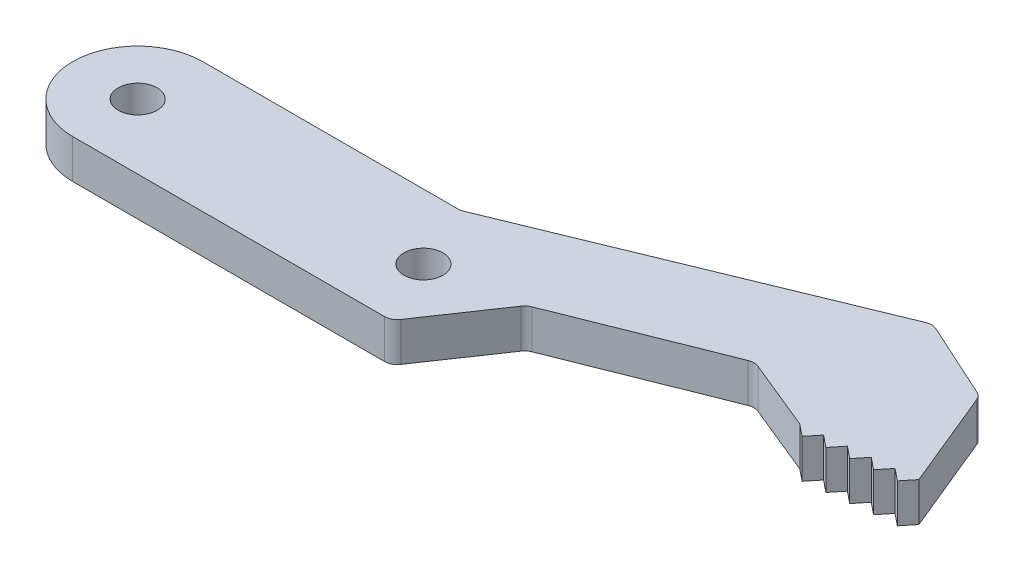
ISO-10303-21;
HEADER;
FILE_DESCRIPTION(('STEP AP214'),'2;1');
FILE_NAME('part.step','',(''),(''),'','','');
FILE_SCHEMA(('AUTOMOTIVE_DESIGN { 1 0 10303 214 1 1 1 1 }'));
ENDSEC;
DATA;
#1=APPLICATION_CONTEXT('core data for automotive mechanical design processes');
#2=APPLICATION_PROTOCOL_DEFINITION('international standard','automotive_design',2000,#1);
#3=PRODUCT_CONTEXT('',#1,'mechanical');
#4=PRODUCT('Part','Part','',(#3));
#5=PRODUCT_RELATED_PRODUCT_CATEGORY('part','',(#4));
#6=PRODUCT_DEFINITION_FORMATION('','',#4);
#7=PRODUCT_DEFINITION_CONTEXT('part definition',#1,'design');
#8=PRODUCT_DEFINITION('design','',#6,#7);
#9=PRODUCT_DEFINITION_SHAPE('','',#8);
#10=(LENGTH_UNIT() NAMED_UNIT(*) SI_UNIT(.MILLI.,.METRE.));
#11=(NAMED_UNIT(*) PLANE_ANGLE_UNIT() SI_UNIT($,.RADIAN.));
#12=(NAMED_UNIT(*) SI_UNIT($,.STERADIAN.) SOLID_ANGLE_UNIT());
#13=UNCERTAINTY_MEASURE_WITH_UNIT(LENGTH_MEASURE(1.E-05),#10,'distance_accuracy_value','');
#14=(GEOMETRIC_REPRESENTATION_CONTEXT(3) GLOBAL_UNCERTAINTY_ASSIGNED_CONTEXT((#13)) GLOBAL_UNIT_ASSIGNED_CONTEXT((#10,
#11,#12)) REPRESENTATION_CONTEXT('',''));
#15=CARTESIAN_POINT('',(0.,0.,0.));
#16=DIRECTION('',(0.,0.,1.));
#17=DIRECTION('',(1.,0.,0.));
#18=AXIS2_PLACEMENT_3D('',#15,#16,#17);
#19=CARTESIAN_POINT('',(33.2201270343521,4.2,2.2384817808513));
#20=DIRECTION('',(0.,-1.,0.));
#21=DIRECTION('',(0.,0.,-1.));
#22=AXIS2_PLACEMENT_3D('',#19,#20,#21);
#23=PLANE('',#22);
#24=CARTESIAN_POINT('',(33.2201270343521,4.2,2.2384817808513));
#25=DIRECTION('',(0.,-1.,0.));
#26=DIRECTION('',(0.,0.,-1.));
#27=AXIS2_PLACEMENT_3D('',#24,#25,#26);
#28=CIRCLE('',#27,1.8);
#29=CARTESIAN_POINT('',(31.7301470261271,4.2,1.22855130052607));
#30=VERTEX_POINT('',#29);
#31=CARTESIAN_POINT('',(32.5534154511187,4.2,0.566508197093927));
#32=VERTEX_POINT('',#31);
#33=EDGE_CURVE('E287',#30,#32,#28,.T.);
#34=ORIENTED_EDGE('',*,*,#33,.T.);
#35=DIRECTION('',(0.92887421319854,0.,-0.370395324018532));
#36=VECTOR('',#35,1.);
#37=CARTESIAN_POINT('',(32.5534154511187,4.2,0.566508197093927));
#38=LINE('',#37,#36);
#39=CARTESIAN_POINT('',(53.9864484293978,4.2,-7.98006902712785));
#40=VERTEX_POINT('',#39);
#41=EDGE_CURVE('E150',#32,#40,#38,.T.);
#42=ORIENTED_EDGE('',*,*,#41,.T.);
#43=CARTESIAN_POINT('',(54.6531600126312,4.2,-6.30809544337048));
#44=DIRECTION('',(0.,-1.,0.));
#45=DIRECTION('',(0.,0.,-1.));
#46=AXIS2_PLACEMENT_3D('',#43,#44,#45);
#47=CIRCLE('',#46,1.8);
#48=CARTESIAN_POINT('',(55.3350182806081,4.2,-7.97394936925703));
#49=VERTEX_POINT('',#48);
#50=EDGE_CURVE('E353',#40,#49,#47,.T.);
#51=ORIENTED_EDGE('',*,*,#50,.T.);
#52=DIRECTION('',(0.925474403270305,0.,0.378810148876022));
#53=VECTOR('',#52,1.);
#54=CARTESIAN_POINT('',(55.3350182806081,4.2,-7.97394936925703));
#55=LINE('',#54,#53);
#56=CARTESIAN_POINT('',(65.1735078784835,4.2,-3.94691232088836));
#57=VERTEX_POINT('',#56);
#58=EDGE_CURVE('E372',#49,#57,#55,.T.);
#59=ORIENTED_EDGE('',*,*,#58,.T.);
#60=DIRECTION('',(0.777249081254573,0.,0.629193027368329));
#61=VECTOR('',#60,1.);
#62=CARTESIAN_POINT('',(65.1735078784835,4.2,-3.94691232088836));
#63=LINE('',#62,#61);
#64=CARTESIAN_POINT('',(66.8243849270682,4.2,-2.61050633075804));
#65=VERTEX_POINT('',#64);
#66=EDGE_CURVE('E369',#57,#65,#63,.T.);
#67=ORIENTED_EDGE('',*,*,#66,.T.);
#68=DIRECTION('',(0.629193027368274,0.,-0.777249081254617));
#69=VECTOR('',#68,1.);
#70=CARTESIAN_POINT('',(66.8243849270682,4.2,-2.61050633075804));
#71=LINE('',#70,#69);
#72=CARTESIAN_POINT('',(68.1607909171984,4.2,-4.26138337934285));
#73=VERTEX_POINT('',#72);
#74=EDGE_CURVE('E371',#65,#73,#71,.T.);
#75=ORIENTED_EDGE('',*,*,#74,.T.);
#76=DIRECTION('',(0.777249081254579,0.,0.62919302736832));
#77=VECTOR('',#76,1.);
#78=CARTESIAN_POINT('',(68.1607909171984,4.2,-4.26138337934285));
#79=LINE('',#78,#77);
#80=CARTESIAN_POINT('',(69.8116679657832,4.2,-2.92497738921252));
#81=VERTEX_POINT('',#80);
#82=EDGE_CURVE('E374',#73,#81,#79,.T.);
#83=ORIENTED_EDGE('',*,*,#82,.T.);
#84=DIRECTION('',(0.629193027368325,0.,-0.777249081254575));
#85=VECTOR('',#84,1.);
#86=CARTESIAN_POINT('',(69.8116679657832,4.2,-2.92497738921252));
#87=LINE('',#86,#85);
#88=CARTESIAN_POINT('',(71.1480739559135,4.2,-4.57585443779724));
#89=VERTEX_POINT('',#88);
#90=EDGE_CURVE('E380',#81,#89,#87,.T.);
#91=ORIENTED_EDGE('',*,*,#90,.T.);
#92=DIRECTION('',(0.777249081254577,0.,0.629193027368323));
#93=VECTOR('',#92,1.);
#94=CARTESIAN_POINT('',(71.1480739559135,4.2,-4.57585443779724));
#95=LINE('',#94,#93);
#96=CARTESIAN_POINT('',(72.7989510044982,4.2,-3.23944844766692));
#97=VERTEX_POINT('',#96);
#98=EDGE_CURVE('E382',#89,#97,#95,.T.);
#99=ORIENTED_EDGE('',*,*,#98,.T.);
#100=DIRECTION('',(0.629193027368326,0.,-0.777249081254575));
#101=VECTOR('',#100,1.);
#102=CARTESIAN_POINT('',(72.7989510044982,4.2,-3.23944844766692));
#103=LINE('',#102,#101);
#104=CARTESIAN_POINT('',(74.1353569946286,4.2,-4.89032549625164));
#105=VERTEX_POINT('',#104);
#106=EDGE_CURVE('E384',#97,#105,#103,.T.);
#107=ORIENTED_EDGE('',*,*,#106,.T.);
#108=DIRECTION('',(0.777249081254583,0.,0.629193027368317));
#109=VECTOR('',#108,1.);
#110=CARTESIAN_POINT('',(74.1353569946286,4.2,-4.89032549625164));
#111=LINE('',#110,#109);
#112=CARTESIAN_POINT('',(75.7862340432133,4.2,-3.55391950612133));
#113=VERTEX_POINT('',#112);
#114=EDGE_CURVE('E386',#105,#113,#111,.T.);
#115=ORIENTED_EDGE('',*,*,#114,.T.);
#116=DIRECTION('',(0.629193027368326,0.,-0.777249081254575));
#117=VECTOR('',#116,1.);
#118=CARTESIAN_POINT('',(75.7862340432133,4.2,-3.55391950612133));
#119=LINE('',#118,#117);
#120=CARTESIAN_POINT('',(77.1226400333436,4.2,-5.20479655470605));
#121=VERTEX_POINT('',#120);
#122=EDGE_CURVE('E388',#113,#121,#119,.T.);
#123=ORIENTED_EDGE('',*,*,#122,.T.);
#124=DIRECTION('',(0.777249081254587,0.,0.629193027368311));
#125=VECTOR('',#124,1.);
#126=CARTESIAN_POINT('',(77.1226400333436,4.2,-5.20479655470605));
#127=LINE('',#126,#125);
#128=CARTESIAN_POINT('',(78.7735170819284,4.2,-3.86839056457575));
#129=VERTEX_POINT('',#128);
#130=EDGE_CURVE('E390',#121,#129,#127,.T.);
#131=ORIENTED_EDGE('',*,*,#130,.T.);
#132=DIRECTION('',(0.629193027368273,0.,-0.777249081254618));
#133=VECTOR('',#132,1.);
#134=CARTESIAN_POINT('',(78.7735170819284,4.2,-3.86839056457575));
#135=LINE('',#134,#133);
#136=CARTESIAN_POINT('',(80.1099230720585,4.2,-5.51926761316053));
#137=VERTEX_POINT('',#136);
#138=EDGE_CURVE('E392',#129,#137,#135,.T.);
#139=ORIENTED_EDGE('',*,*,#138,.T.);
#140=DIRECTION('',(-0.380263412733204,0.,-0.92487822816655));
#141=VECTOR('',#140,1.);
#142=CARTESIAN_POINT('',(74.5283952923221,4.2,-19.094682313935));
#143=LINE('',#142,#141);
#144=CARTESIAN_POINT('',(74.5283952923221,4.2,-19.094682313935));
#145=VERTEX_POINT('',#144);
#146=EDGE_CURVE('E394',#137,#145,#143,.T.);
#147=ORIENTED_EDGE('',*,*,#146,.T.);
#148=CARTESIAN_POINT('',(72.8636144816223,4.2,-18.4102081710152));
#149=DIRECTION('',(0.,1.,0.));
#150=DIRECTION('',(0.,0.,-1.));
#151=AXIS2_PLACEMENT_3D('',#148,#149,#150);
#152=CIRCLE('',#151,1.8);
#153=CARTESIAN_POINT('',(73.6097764342716,4.2,-20.0482687133697));
#154=VERTEX_POINT('',#153);
#155=EDGE_CURVE('E396',#145,#154,#152,.T.);
#156=ORIENTED_EDGE('',*,*,#155,.T.);
#157=DIRECTION('',(-0.910033634641374,0.,-0.414534418138482));
#158=VECTOR('',#157,1.);
#159=CARTESIAN_POINT('',(63.1567837034656,4.2,-24.8097688321845));
#160=LINE('',#159,#158);
#161=CARTESIAN_POINT('',(63.1567837034656,4.2,-24.8097688321845));
#162=VERTEX_POINT('',#161);
#163=EDGE_CURVE('E398',#154,#162,#160,.T.);
#164=ORIENTED_EDGE('',*,*,#163,.T.);
#165=CARTESIAN_POINT('',(62.4106217508164,4.2,-23.1717082898301));
#166=DIRECTION('',(0.,1.,0.));
#167=DIRECTION('',(0.,0.,-1.));
#168=AXIS2_PLACEMENT_3D('',#165,#166,#167);
#169=CIRCLE('',#168,1.8);
#170=CARTESIAN_POINT('',(61.7261476078966,4.2,-24.8364891005299));
#171=VERTEX_POINT('',#170);
#172=EDGE_CURVE('E400',#162,#171,#169,.T.);
#173=ORIENTED_EDGE('',*,*,#172,.T.);
#174=DIRECTION('',(-0.924878228166549,0.,0.380263412733207));
#175=VECTOR('',#174,1.);
#176=CARTESIAN_POINT('',(16.3721333051375,4.2,-6.18919939828796));
#177=LINE('',#176,#175);
#178=CARTESIAN_POINT('',(16.3721333051375,4.2,-6.18919939828796));
#179=VERTEX_POINT('',#178);
#180=EDGE_CURVE('E402',#171,#179,#177,.T.);
#181=ORIENTED_EDGE('',*,*,#180,.T.);
#182=CARTESIAN_POINT('',(15.6876591622178,4.2,-7.85398020898774));
#183=DIRECTION('',(0.,-1.,0.));
#184=DIRECTION('',(0.,0.,1.));
#185=AXIS2_PLACEMENT_3D('',#182,#183,#184);
#186=CIRCLE('',#185,1.8);
#187=CARTESIAN_POINT('',(15.6876591622177,4.2,-6.05398020898774));
#188=VERTEX_POINT('',#187);
#189=EDGE_CURVE('E404',#179,#188,#186,.T.);
#190=ORIENTED_EDGE('',*,*,#189,.T.);
#191=DIRECTION('',(-1.,0.,0.));
#192=VECTOR('',#191,1.);
#193=CARTESIAN_POINT('',(-19.6867473602812,4.2,-6.05398020898774));
#194=LINE('',#193,#192);
#195=CARTESIAN_POINT('',(-19.6867473602812,4.2,-6.05398020898774));
#196=VERTEX_POINT('',#195);
#197=EDGE_CURVE('E406',#188,#196,#194,.T.);
#198=ORIENTED_EDGE('',*,*,#197,.T.);
#199=CARTESIAN_POINT('',(-19.6867473602812,4.2,2.94601979101225));
#200=DIRECTION('',(0.,1.,0.));
#201=DIRECTION('',(0.,0.,1.));
#202=AXIS2_PLACEMENT_3D('',#199,#200,#201);
#203=CIRCLE('',#202,9.);
#204=CARTESIAN_POINT('',(-19.6867473602812,4.2,11.9460197910123));
#205=VERTEX_POINT('',#204);
#206=EDGE_CURVE('E220',#196,#205,#203,.T.);
#207=ORIENTED_EDGE('',*,*,#206,.T.);
#208=DIRECTION('',(1.,0.,0.));
#209=VECTOR('',#208,1.);
#210=CARTESIAN_POINT('',(-19.6867473602812,4.2,11.9460197910123));
#211=LINE('',#210,#209);
#212=CARTESIAN_POINT('',(23.5112292095915,4.2,11.9460197910123));
#213=VERTEX_POINT('',#212);
#214=EDGE_CURVE('E214',#205,#213,#211,.T.);
#215=ORIENTED_EDGE('',*,*,#214,.T.);
#216=CARTESIAN_POINT('',(23.5112292095915,4.2,10.1460197910123));
#217=DIRECTION('',(0.,1.,0.));
#218=DIRECTION('',(0.,0.,1.));
#219=AXIS2_PLACEMENT_3D('',#216,#217,#218);
#220=CIRCLE('',#219,1.8);
#221=CARTESIAN_POINT('',(25.0012092178165,4.2,11.1559502713375));
#222=VERTEX_POINT('',#221);
#223=EDGE_CURVE('E218',#213,#222,#220,.T.);
#224=ORIENTED_EDGE('',*,*,#223,.T.);
#225=DIRECTION('',(0.561072489069578,0.,-0.827766671236085));
#226=VECTOR('',#225,1.);
#227=CARTESIAN_POINT('',(25.0012092178165,4.2,11.1559502713375));
#228=LINE('',#227,#226);
#229=EDGE_CURVE('E56',#222,#30,#228,.T.);
#230=ORIENTED_EDGE('',*,*,#229,.T.);
#231=EDGE_LOOP('',(#34,#42,#51,#59,#67,#75,#83,#91,#99,#107,#115,#123,#131,#139,#147,#156,#164,
#173,#181,#190,#198,#207,#215,#224,#230));
#232=FACE_BOUND('',#231,.T.);
#233=CARTESIAN_POINT('',(-19.6867473602812,4.2,2.94601979101225));
#234=DIRECTION('',(0.,1.,0.));
#235=DIRECTION('',(0.,0.,1.));
#236=AXIS2_PLACEMENT_3D('',#233,#234,#235);
#237=CIRCLE('',#236,2.7);
#238=CARTESIAN_POINT('',(-19.6867473602812,4.2,5.64601979101226));
#239=VERTEX_POINT('',#238);
#240=EDGE_CURVE('E242',#239,#239,#237,.T.);
#241=ORIENTED_EDGE('',*,*,#240,.F.);
#242=EDGE_LOOP('',(#241));
#243=FACE_BOUND('',#242,.T.);
#244=CARTESIAN_POINT('',(19.9132526397188,4.2,2.94601979101225));
#245=DIRECTION('',(0.,1.,0.));
#246=DIRECTION('',(0.,0.,1.));
#247=AXIS2_PLACEMENT_3D('',#244,#245,#246);
#248=CIRCLE('',#247,2.7);
#249=CARTESIAN_POINT('',(19.9132526397188,4.2,5.64601979101226));
#250=VERTEX_POINT('',#249);
#251=EDGE_CURVE('E447',#250,#250,#248,.T.);
#252=ORIENTED_EDGE('',*,*,#251,.F.);
#253=EDGE_LOOP('',(#252));
#254=FACE_BOUND('',#253,.T.);
#255=ADVANCED_FACE('F39',(#232,#243,#254),#23,.F.);
#256=CARTESIAN_POINT('',(33.2201270343521,-1.2,2.2384817808513));
#257=DIRECTION('',(0.,-1.,0.));
#258=DIRECTION('',(0.,0.,-1.));
#259=AXIS2_PLACEMENT_3D('',#256,#257,#258);
#260=PLANE('',#259);
#261=CARTESIAN_POINT('',(-19.6867473602812,-1.2,2.94601979101225));
#262=DIRECTION('',(0.,1.,0.));
#263=DIRECTION('',(0.,0.,1.));
#264=AXIS2_PLACEMENT_3D('',#261,#262,#263);
#265=CIRCLE('',#264,2.7);
#266=CARTESIAN_POINT('',(-19.6867473602812,-1.2,5.64601979101226));
#267=VERTEX_POINT('',#266);
#268=EDGE_CURVE('E452',#267,#267,#265,.T.);
#269=ORIENTED_EDGE('',*,*,#268,.T.);
#270=EDGE_LOOP('',(#269));
#271=FACE_BOUND('',#270,.T.);
#272=CARTESIAN_POINT('',(33.2201270343521,-1.2,2.2384817808513));
#273=DIRECTION('',(0.,-1.,0.));
#274=DIRECTION('',(0.,0.,-1.));
#275=AXIS2_PLACEMENT_3D('',#272,#273,#274);
#276=CIRCLE('',#275,1.8);
#277=CARTESIAN_POINT('',(31.7301470261271,-1.2,1.22855130052607));
#278=VERTEX_POINT('',#277);
#279=CARTESIAN_POINT('',(32.5534154511187,-1.2,0.566508197093927));
#280=VERTEX_POINT('',#279);
#281=EDGE_CURVE('E238',#278,#280,#276,.T.);
#282=ORIENTED_EDGE('',*,*,#281,.F.);
#283=DIRECTION('',(0.561072489069578,0.,-0.827766671236085));
#284=VECTOR('',#283,1.);
#285=CARTESIAN_POINT('',(25.0012092178165,-1.2,11.1559502713375));
#286=LINE('',#285,#284);
#287=CARTESIAN_POINT('',(25.0012092178165,-1.2,11.1559502713375));
#288=VERTEX_POINT('',#287);
#289=EDGE_CURVE('E142',#288,#278,#286,.T.);
#290=ORIENTED_EDGE('',*,*,#289,.F.);
#291=CARTESIAN_POINT('',(23.5112292095915,-1.2,10.1460197910123));
#292=DIRECTION('',(0.,1.,0.));
#293=DIRECTION('',(0.,0.,1.));
#294=AXIS2_PLACEMENT_3D('',#291,#292,#293);
#295=CIRCLE('',#294,1.8);
#296=CARTESIAN_POINT('',(23.5112292095915,-1.2,11.9460197910123));
#297=VERTEX_POINT('',#296);
#298=EDGE_CURVE('E136',#297,#288,#295,.T.);
#299=ORIENTED_EDGE('',*,*,#298,.F.);
#300=DIRECTION('',(1.,0.,0.));
#301=VECTOR('',#300,1.);
#302=CARTESIAN_POINT('',(-19.6867473602812,-1.2,11.9460197910123));
#303=LINE('',#302,#301);
#304=CARTESIAN_POINT('',(-19.6867473602812,-1.2,11.9460197910123));
#305=VERTEX_POINT('',#304);
#306=EDGE_CURVE('E228',#305,#297,#303,.T.);
#307=ORIENTED_EDGE('',*,*,#306,.F.);
#308=CARTESIAN_POINT('',(-19.6867473602812,-1.2,2.94601979101225));
#309=DIRECTION('',(0.,1.,0.));
#310=DIRECTION('',(0.,0.,1.));
#311=AXIS2_PLACEMENT_3D('',#308,#309,#310);
#312=CIRCLE('',#311,9.);
#313=CARTESIAN_POINT('',(-19.6867473602812,-1.2,-6.05398020898774));
#314=VERTEX_POINT('',#313);
#315=EDGE_CURVE('E282',#314,#305,#312,.T.);
#316=ORIENTED_EDGE('',*,*,#315,.F.);
#317=DIRECTION('',(-1.,0.,0.));
#318=VECTOR('',#317,1.);
#319=CARTESIAN_POINT('',(-19.6867473602812,-1.2,-6.05398020898774));
#320=LINE('',#319,#318);
#321=CARTESIAN_POINT('',(15.6876591622177,-1.2,-6.05398020898774));
#322=VERTEX_POINT('',#321);
#323=EDGE_CURVE('E280',#322,#314,#320,.T.);
#324=ORIENTED_EDGE('',*,*,#323,.F.);
#325=CARTESIAN_POINT('',(15.6876591622178,-1.2,-7.85398020898774));
#326=DIRECTION('',(0.,-1.,0.));
#327=DIRECTION('',(0.,0.,1.));
#328=AXIS2_PLACEMENT_3D('',#325,#326,#327);
#329=CIRCLE('',#328,1.8);
#330=CARTESIAN_POINT('',(16.3721333051375,-1.2,-6.18919939828796));
#331=VERTEX_POINT('',#330);
#332=EDGE_CURVE('E278',#331,#322,#329,.T.);
#333=ORIENTED_EDGE('',*,*,#332,.F.);
#334=DIRECTION('',(-0.924878228166549,0.,0.380263412733207));
#335=VECTOR('',#334,1.);
#336=CARTESIAN_POINT('',(16.3721333051375,-1.2,-6.18919939828796));
#337=LINE('',#336,#335);
#338=CARTESIAN_POINT('',(61.7261476078966,-1.2,-24.8364891005299));
#339=VERTEX_POINT('',#338);
#340=EDGE_CURVE('E276',#339,#331,#337,.T.);
#341=ORIENTED_EDGE('',*,*,#340,.F.);
#342=CARTESIAN_POINT('',(62.4106217508164,-1.2,-23.1717082898301));
#343=DIRECTION('',(0.,1.,0.));
#344=DIRECTION('',(0.,0.,-1.));
#345=AXIS2_PLACEMENT_3D('',#342,#343,#344);
#346=CIRCLE('',#345,1.8);
#347=CARTESIAN_POINT('',(63.1567837034656,-1.2,-24.8097688321845));
#348=VERTEX_POINT('',#347);
#349=EDGE_CURVE('E274',#348,#339,#346,.T.);
#350=ORIENTED_EDGE('',*,*,#349,.F.);
#351=DIRECTION('',(-0.910033634641374,0.,-0.414534418138482));
#352=VECTOR('',#351,1.);
#353=CARTESIAN_POINT('',(63.1567837034656,-1.2,-24.8097688321845));
#354=LINE('',#353,#352);
#355=CARTESIAN_POINT('',(73.6097764342716,-1.2,-20.0482687133697));
#356=VERTEX_POINT('',#355);
#357=EDGE_CURVE('E272',#356,#348,#354,.T.);
#358=ORIENTED_EDGE('',*,*,#357,.F.);
#359=CARTESIAN_POINT('',(72.8636144816223,-1.2,-18.4102081710152));
#360=DIRECTION('',(0.,1.,0.));
#361=DIRECTION('',(0.,0.,-1.));
#362=AXIS2_PLACEMENT_3D('',#359,#360,#361);
#363=CIRCLE('',#362,1.8);
#364=CARTESIAN_POINT('',(74.5283952923221,-1.2,-19.094682313935));
#365=VERTEX_POINT('',#364);
#366=EDGE_CURVE('E270',#365,#356,#363,.T.);
#367=ORIENTED_EDGE('',*,*,#366,.F.);
#368=DIRECTION('',(-0.380263412733204,0.,-0.92487822816655));
#369=VECTOR('',#368,1.);
#370=CARTESIAN_POINT('',(74.5283952923221,-1.2,-19.094682313935));
#371=LINE('',#370,#369);
#372=CARTESIAN_POINT('',(80.1099230720585,-1.2,-5.51926761316053));
#373=VERTEX_POINT('',#372);
#374=EDGE_CURVE('E268',#373,#365,#371,.T.);
#375=ORIENTED_EDGE('',*,*,#374,.F.);
#376=DIRECTION('',(0.629193027368273,0.,-0.777249081254618));
#377=VECTOR('',#376,1.);
#378=CARTESIAN_POINT('',(78.7735170819284,-1.2,-3.86839056457575));
#379=LINE('',#378,#377);
#380=CARTESIAN_POINT('',(78.7735170819284,-1.2,-3.86839056457575));
#381=VERTEX_POINT('',#380);
#382=EDGE_CURVE('E266',#381,#373,#379,.T.);
#383=ORIENTED_EDGE('',*,*,#382,.F.);
#384=DIRECTION('',(0.777249081254587,0.,0.629193027368311));
#385=VECTOR('',#384,1.);
#386=CARTESIAN_POINT('',(77.1226400333436,-1.2,-5.20479655470605));
#387=LINE('',#386,#385);
#388=CARTESIAN_POINT('',(77.1226400333436,-1.2,-5.20479655470605));
#389=VERTEX_POINT('',#388);
#390=EDGE_CURVE('E264',#389,#381,#387,.T.);
#391=ORIENTED_EDGE('',*,*,#390,.F.);
#392=DIRECTION('',(0.629193027368326,0.,-0.777249081254575));
#393=VECTOR('',#392,1.);
#394=CARTESIAN_POINT('',(75.7862340432133,-1.2,-3.55391950612133));
#395=LINE('',#394,#393);
#396=CARTESIAN_POINT('',(75.7862340432133,-1.2,-3.55391950612133));
#397=VERTEX_POINT('',#396);
#398=EDGE_CURVE('E262',#397,#389,#395,.T.);
#399=ORIENTED_EDGE('',*,*,#398,.F.);
#400=DIRECTION('',(0.777249081254583,0.,0.629193027368317));
#401=VECTOR('',#400,1.);
#402=CARTESIAN_POINT('',(74.1353569946286,-1.2,-4.89032549625164));
#403=LINE('',#402,#401);
#404=CARTESIAN_POINT('',(74.1353569946286,-1.2,-4.89032549625164));
#405=VERTEX_POINT('',#404);
#406=EDGE_CURVE('E260',#405,#397,#403,.T.);
#407=ORIENTED_EDGE('',*,*,#406,.F.);
#408=DIRECTION('',(0.629193027368326,0.,-0.777249081254575));
#409=VECTOR('',#408,1.);
#410=CARTESIAN_POINT('',(72.7989510044982,-1.2,-3.23944844766692));
#411=LINE('',#410,#409);
#412=CARTESIAN_POINT('',(72.7989510044982,-1.2,-3.23944844766692));
#413=VERTEX_POINT('',#412);
#414=EDGE_CURVE('E258',#413,#405,#411,.T.);
#415=ORIENTED_EDGE('',*,*,#414,.F.);
#416=DIRECTION('',(0.777249081254577,0.,0.629193027368323));
#417=VECTOR('',#416,1.);
#418=CARTESIAN_POINT('',(71.1480739559135,-1.2,-4.57585443779724));
#419=LINE('',#418,#417);
#420=CARTESIAN_POINT('',(71.1480739559135,-1.2,-4.57585443779724));
#421=VERTEX_POINT('',#420);
#422=EDGE_CURVE('E256',#421,#413,#419,.T.);
#423=ORIENTED_EDGE('',*,*,#422,.F.);
#424=DIRECTION('',(0.629193027368325,0.,-0.777249081254575));
#425=VECTOR('',#424,1.);
#426=CARTESIAN_POINT('',(69.8116679657832,-1.2,-2.92497738921252));
#427=LINE('',#426,#425);
#428=CARTESIAN_POINT('',(69.8116679657832,-1.2,-2.92497738921252));
#429=VERTEX_POINT('',#428);
#430=EDGE_CURVE('E254',#429,#421,#427,.T.);
#431=ORIENTED_EDGE('',*,*,#430,.F.);
#432=DIRECTION('',(0.777249081254579,0.,0.62919302736832));
#433=VECTOR('',#432,1.);
#434=CARTESIAN_POINT('',(68.1607909171984,-1.2,-4.26138337934285));
#435=LINE('',#434,#433);
#436=CARTESIAN_POINT('',(68.1607909171984,-1.2,-4.26138337934285));
#437=VERTEX_POINT('',#436);
#438=EDGE_CURVE('E252',#437,#429,#435,.T.);
#439=ORIENTED_EDGE('',*,*,#438,.F.);
#440=DIRECTION('',(0.629193027368274,0.,-0.777249081254617));
#441=VECTOR('',#440,1.);
#442=CARTESIAN_POINT('',(66.8243849270682,-1.2,-2.61050633075804));
#443=LINE('',#442,#441);
#444=CARTESIAN_POINT('',(66.8243849270682,-1.2,-2.61050633075804));
#445=VERTEX_POINT('',#444);
#446=EDGE_CURVE('E250',#445,#437,#443,.T.);
#447=ORIENTED_EDGE('',*,*,#446,.F.);
#448=DIRECTION('',(0.777249081254573,0.,0.629193027368329));
#449=VECTOR('',#448,1.);
#450=CARTESIAN_POINT('',(65.1735078784835,-1.2,-3.94691232088836));
#451=LINE('',#450,#449);
#452=CARTESIAN_POINT('',(65.1735078784835,-1.2,-3.94691232088836));
#453=VERTEX_POINT('',#452);
#454=EDGE_CURVE('E248',#453,#445,#451,.T.);
#455=ORIENTED_EDGE('',*,*,#454,.F.);
#456=DIRECTION('',(0.925474403270305,0.,0.378810148876022));
#457=VECTOR('',#456,1.);
#458=CARTESIAN_POINT('',(55.3350182806081,-1.2,-7.97394936925703));
#459=LINE('',#458,#457);
#460=CARTESIAN_POINT('',(55.3350182806081,-1.2,-7.97394936925703));
#461=VERTEX_POINT('',#460);
#462=EDGE_CURVE('E246',#461,#453,#459,.T.);
#463=ORIENTED_EDGE('',*,*,#462,.F.);
#464=CARTESIAN_POINT('',(54.6531600126312,-1.2,-6.30809544337048));
#465=DIRECTION('',(0.,-1.,0.));
#466=DIRECTION('',(0.,0.,-1.));
#467=AXIS2_PLACEMENT_3D('',#464,#465,#466);
#468=CIRCLE('',#467,1.8);
#469=CARTESIAN_POINT('',(53.9864484293978,-1.2,-7.98006902712785));
#470=VERTEX_POINT('',#469);
#471=EDGE_CURVE('E244',#470,#461,#468,.T.);
#472=ORIENTED_EDGE('',*,*,#471,.F.);
#473=DIRECTION('',(0.92887421319854,0.,-0.370395324018532));
#474=VECTOR('',#473,1.);
#475=CARTESIAN_POINT('',(32.5534154511187,-1.2,0.566508197093927));
#476=LINE('',#475,#474);
#477=EDGE_CURVE('E241',#280,#470,#476,.T.);
#478=ORIENTED_EDGE('',*,*,#477,.F.);
#479=EDGE_LOOP('',(#282,#290,#299,#307,#316,#324,#333,#341,#350,#358,#367,#375,#383,#391,#399,
#407,#415,#423,#431,#439,#447,#455,#463,#472,#478));
#480=FACE_BOUND('',#479,.T.);
#481=CARTESIAN_POINT('',(19.9132526397188,-1.2,2.94601979101225));
#482=DIRECTION('',(0.,1.,0.));
#483=DIRECTION('',(0.,0.,1.));
#484=AXIS2_PLACEMENT_3D('',#481,#482,#483);
#485=CIRCLE('',#484,2.7);
#486=CARTESIAN_POINT('',(19.9132526397188,-1.2,5.64601979101226));
#487=VERTEX_POINT('',#486);
#488=EDGE_CURVE('E450',#487,#487,#485,.T.);
#489=ORIENTED_EDGE('',*,*,#488,.T.);
#490=EDGE_LOOP('',(#489));
#491=FACE_BOUND('',#490,.T.);
#492=ADVANCED_FACE('F357',(#271,#480,#491),#260,.T.);
#493=CARTESIAN_POINT('',(33.2201270343521,4.2,2.2384817808513));
#494=DIRECTION('',(0.,-1.,0.));
#495=DIRECTION('',(0.,0.,-1.));
#496=AXIS2_PLACEMENT_3D('',#493,#494,#495);
#497=CYLINDRICAL_SURFACE('',#496,1.8);
#498=ORIENTED_EDGE('',*,*,#281,.T.);
#499=DIRECTION('',(0.,-1.,0.));
#500=VECTOR('',#499,1.);
#501=CARTESIAN_POINT('',(32.5534154511187,4.2,0.566508197093927));
#502=LINE('',#501,#500);
#503=EDGE_CURVE('E11',#32,#280,#502,.T.);
#504=ORIENTED_EDGE('',*,*,#503,.F.);
#505=ORIENTED_EDGE('',*,*,#33,.F.);
#506=DIRECTION('',(0.,-1.,0.));
#507=VECTOR('',#506,1.);
#508=CARTESIAN_POINT('',(31.7301470261271,4.2,1.22855130052607));
#509=LINE('',#508,#507);
#510=EDGE_CURVE('E234',#30,#278,#509,.T.);
#511=ORIENTED_EDGE('',*,*,#510,.T.);
#512=EDGE_LOOP('',(#498,#504,#505,#511));
#513=FACE_BOUND('',#512,.T.);
#514=ADVANCED_FACE('F41',(#513),#497,.F.);
#515=CARTESIAN_POINT('',(32.5534154511187,4.2,0.566508197093927));
#516=DIRECTION('',(-0.370395324018532,0.,-0.92887421319854));
#517=DIRECTION('',(-0.92887421319854,0.,0.370395324018532));
#518=AXIS2_PLACEMENT_3D('',#515,#516,#517);
#519=PLANE('',#518);
#520=ORIENTED_EDGE('',*,*,#477,.T.);
#521=DIRECTION('',(0.,-1.,0.));
#522=VECTOR('',#521,1.);
#523=CARTESIAN_POINT('',(53.9864484293978,4.2,-7.98006902712785));
#524=LINE('',#523,#522);
#525=EDGE_CURVE('E48',#40,#470,#524,.T.);
#526=ORIENTED_EDGE('',*,*,#525,.F.);
#527=ORIENTED_EDGE('',*,*,#41,.F.);
#528=ORIENTED_EDGE('',*,*,#503,.T.);
#529=EDGE_LOOP('',(#520,#526,#527,#528));
#530=FACE_BOUND('',#529,.T.);
#531=ADVANCED_FACE('F700',(#530),#519,.F.);
#532=CARTESIAN_POINT('',(54.6531600126312,4.2,-6.30809544337048));
#533=DIRECTION('',(0.,-1.,0.));
#534=DIRECTION('',(0.,0.,-1.));
#535=AXIS2_PLACEMENT_3D('',#532,#533,#534);
#536=CYLINDRICAL_SURFACE('',#535,1.8);
#537=ORIENTED_EDGE('',*,*,#471,.T.);
#538=DIRECTION('',(0.,-1.,0.));
#539=VECTOR('',#538,1.);
#540=CARTESIAN_POINT('',(55.3350182806081,4.2,-7.97394936925703));
#541=LINE('',#540,#539);
#542=EDGE_CURVE('E345',#49,#461,#541,.T.);
#543=ORIENTED_EDGE('',*,*,#542,.F.);
#544=ORIENTED_EDGE('',*,*,#50,.F.);
#545=ORIENTED_EDGE('',*,*,#525,.T.);
#546=EDGE_LOOP('',(#537,#543,#544,#545));
#547=FACE_BOUND('',#546,.T.);
#548=ADVANCED_FACE('F351',(#547),#536,.F.);
#549=CARTESIAN_POINT('',(55.3350182806081,4.2,-7.97394936925703));
#550=DIRECTION('',(0.378810148876022,0.,-0.925474403270305));
#551=DIRECTION('',(-0.925474403270305,0.,-0.378810148876022));
#552=AXIS2_PLACEMENT_3D('',#549,#550,#551);
#553=PLANE('',#552);
#554=ORIENTED_EDGE('',*,*,#462,.T.);
#555=DIRECTION('',(0.,-1.,0.));
#556=VECTOR('',#555,1.);
#557=CARTESIAN_POINT('',(65.1735078784835,4.2,-3.94691232088836));
#558=LINE('',#557,#556);
#559=EDGE_CURVE('E342',#57,#453,#558,.T.);
#560=ORIENTED_EDGE('',*,*,#559,.F.);
#561=ORIENTED_EDGE('',*,*,#58,.F.);
#562=ORIENTED_EDGE('',*,*,#542,.T.);
#563=EDGE_LOOP('',(#554,#560,#561,#562));
#564=FACE_BOUND('',#563,.T.);
#565=ADVANCED_FACE('F363',(#564),#553,.F.);
#566=CARTESIAN_POINT('',(65.1735078784835,4.2,-3.94691232088836));
#567=DIRECTION('',(0.629193027368329,0.,-0.777249081254573));
#568=DIRECTION('',(-0.777249081254573,0.,-0.629193027368329));
#569=AXIS2_PLACEMENT_3D('',#566,#567,#568);
#570=PLANE('',#569);
#571=ORIENTED_EDGE('',*,*,#454,.T.);
#572=DIRECTION('',(0.,-1.,0.));
#573=VECTOR('',#572,1.);
#574=CARTESIAN_POINT('',(66.8243849270682,4.2,-2.61050633075804));
#575=LINE('',#574,#573);
#576=EDGE_CURVE('E339',#65,#445,#575,.T.);
#577=ORIENTED_EDGE('',*,*,#576,.F.);
#578=ORIENTED_EDGE('',*,*,#66,.F.);
#579=ORIENTED_EDGE('',*,*,#559,.T.);
#580=EDGE_LOOP('',(#571,#577,#578,#579));
#581=FACE_BOUND('',#580,.T.);
#582=ADVANCED_FACE('F367',(#581),#570,.F.);
#583=CARTESIAN_POINT('',(66.8243849270682,4.2,-2.61050633075804));
#584=DIRECTION('',(-0.777249081254617,0.,-0.629193027368274));
#585=DIRECTION('',(-0.629193027368274,0.,0.777249081254617));
#586=AXIS2_PLACEMENT_3D('',#583,#584,#585);
#587=PLANE('',#586);
#588=ORIENTED_EDGE('',*,*,#446,.T.);
#589=DIRECTION('',(0.,-1.,0.));
#590=VECTOR('',#589,1.);
#591=CARTESIAN_POINT('',(68.1607909171984,4.2,-4.26138337934285));
#592=LINE('',#591,#590);
#593=EDGE_CURVE('E336',#73,#437,#592,.T.);
#594=ORIENTED_EDGE('',*,*,#593,.F.);
#595=ORIENTED_EDGE('',*,*,#74,.F.);
#596=ORIENTED_EDGE('',*,*,#576,.T.);
#597=EDGE_LOOP('',(#588,#594,#595,#596));
#598=FACE_BOUND('',#597,.T.);
#599=ADVANCED_FACE('F661',(#598),#587,.F.);
#600=CARTESIAN_POINT('',(68.1607909171984,4.2,-4.26138337934285));
#601=DIRECTION('',(0.62919302736832,0.,-0.77724908125458));
#602=DIRECTION('',(-0.77724908125458,0.,-0.62919302736832));
#603=AXIS2_PLACEMENT_3D('',#600,#601,#602);
#604=PLANE('',#603);
#605=ORIENTED_EDGE('',*,*,#438,.T.);
#606=DIRECTION('',(0.,-1.,0.));
#607=VECTOR('',#606,1.);
#608=CARTESIAN_POINT('',(69.8116679657832,4.2,-2.92497738921252));
#609=LINE('',#608,#607);
#610=EDGE_CURVE('E333',#81,#429,#609,.T.);
#611=ORIENTED_EDGE('',*,*,#610,.F.);
#612=ORIENTED_EDGE('',*,*,#82,.F.);
#613=ORIENTED_EDGE('',*,*,#593,.T.);
#614=EDGE_LOOP('',(#605,#611,#612,#613));
#615=FACE_BOUND('',#614,.T.);
#616=ADVANCED_FACE('F650',(#615),#604,.F.);
#617=CARTESIAN_POINT('',(69.8116679657832,4.2,-2.92497738921252));
#618=DIRECTION('',(-0.777249081254575,0.,-0.629193027368325));
#619=DIRECTION('',(-0.629193027368325,0.,0.777249081254576));
#620=AXIS2_PLACEMENT_3D('',#617,#618,#619);
#621=PLANE('',#620);
#622=ORIENTED_EDGE('',*,*,#430,.T.);
#623=DIRECTION('',(0.,-1.,0.));
#624=VECTOR('',#623,1.);
#625=CARTESIAN_POINT('',(71.1480739559135,4.2,-4.57585443779724));
#626=LINE('',#625,#624);
#627=EDGE_CURVE('E330',#89,#421,#626,.T.);
#628=ORIENTED_EDGE('',*,*,#627,.F.);
#629=ORIENTED_EDGE('',*,*,#90,.F.);
#630=ORIENTED_EDGE('',*,*,#610,.T.);
#631=EDGE_LOOP('',(#622,#628,#629,#630));
#632=FACE_BOUND('',#631,.T.);
#633=ADVANCED_FACE('F639',(#632),#621,.F.);
#634=CARTESIAN_POINT('',(71.1480739559135,4.2,-4.57585443779724));
#635=DIRECTION('',(0.629193027368323,0.,-0.777249081254577));
#636=DIRECTION('',(-0.777249081254577,0.,-0.629193027368323));
#637=AXIS2_PLACEMENT_3D('',#634,#635,#636);
#638=PLANE('',#637);
#639=ORIENTED_EDGE('',*,*,#422,.T.);
#640=DIRECTION('',(0.,-1.,0.));
#641=VECTOR('',#640,1.);
#642=CARTESIAN_POINT('',(72.7989510044982,4.2,-3.23944844766692));
#643=LINE('',#642,#641);
#644=EDGE_CURVE('E327',#97,#413,#643,.T.);
#645=ORIENTED_EDGE('',*,*,#644,.F.);
#646=ORIENTED_EDGE('',*,*,#98,.F.);
#647=ORIENTED_EDGE('',*,*,#627,.T.);
#648=EDGE_LOOP('',(#639,#645,#646,#647));
#649=FACE_BOUND('',#648,.T.);
#650=ADVANCED_FACE('F628',(#649),#638,.F.);
#651=CARTESIAN_POINT('',(72.7989510044982,4.2,-3.23944844766692));
#652=DIRECTION('',(-0.777249081254575,0.,-0.629193027368326));
#653=DIRECTION('',(-0.629193027368326,0.,0.777249081254575));
#654=AXIS2_PLACEMENT_3D('',#651,#652,#653);
#655=PLANE('',#654);
#656=ORIENTED_EDGE('',*,*,#414,.T.);
#657=DIRECTION('',(0.,-1.,0.));
#658=VECTOR('',#657,1.);
#659=CARTESIAN_POINT('',(74.1353569946286,4.2,-4.89032549625164));
#660=LINE('',#659,#658);
#661=EDGE_CURVE('E324',#105,#405,#660,.T.);
#662=ORIENTED_EDGE('',*,*,#661,.F.);
#663=ORIENTED_EDGE('',*,*,#106,.F.);
#664=ORIENTED_EDGE('',*,*,#644,.T.);
#665=EDGE_LOOP('',(#656,#662,#663,#664));
#666=FACE_BOUND('',#665,.T.);
#667=ADVANCED_FACE('F617',(#666),#655,.F.);
#668=CARTESIAN_POINT('',(74.1353569946286,4.2,-4.89032549625164));
#669=DIRECTION('',(0.629193027368317,0.,-0.777249081254583));
#670=DIRECTION('',(-0.777249081254583,0.,-0.629193027368317));
#671=AXIS2_PLACEMENT_3D('',#668,#669,#670);
#672=PLANE('',#671);
#673=ORIENTED_EDGE('',*,*,#406,.T.);
#674=DIRECTION('',(0.,-1.,0.));
#675=VECTOR('',#674,1.);
#676=CARTESIAN_POINT('',(75.7862340432133,4.2,-3.55391950612133));
#677=LINE('',#676,#675);
#678=EDGE_CURVE('E321',#113,#397,#677,.T.);
#679=ORIENTED_EDGE('',*,*,#678,.F.);
#680=ORIENTED_EDGE('',*,*,#114,.F.);
#681=ORIENTED_EDGE('',*,*,#661,.T.);
#682=EDGE_LOOP('',(#673,#679,#680,#681));
#683=FACE_BOUND('',#682,.T.);
#684=ADVANCED_FACE('F606',(#683),#672,.F.);
#685=CARTESIAN_POINT('',(75.7862340432133,4.2,-3.55391950612133));
#686=DIRECTION('',(-0.777249081254575,0.,-0.629193027368326));
#687=DIRECTION('',(-0.629193027368326,0.,0.777249081254575));
#688=AXIS2_PLACEMENT_3D('',#685,#686,#687);
#689=PLANE('',#688);
#690=ORIENTED_EDGE('',*,*,#398,.T.);
#691=DIRECTION('',(0.,-1.,0.));
#692=VECTOR('',#691,1.);
#693=CARTESIAN_POINT('',(77.1226400333436,4.2,-5.20479655470605));
#694=LINE('',#693,#692);
#695=EDGE_CURVE('E318',#121,#389,#694,.T.);
#696=ORIENTED_EDGE('',*,*,#695,.F.);
#697=ORIENTED_EDGE('',*,*,#122,.F.);
#698=ORIENTED_EDGE('',*,*,#678,.T.);
#699=EDGE_LOOP('',(#690,#696,#697,#698));
#700=FACE_BOUND('',#699,.T.);
#701=ADVANCED_FACE('F595',(#700),#689,.F.);
#702=CARTESIAN_POINT('',(77.1226400333436,4.2,-5.20479655470605));
#703=DIRECTION('',(0.629193027368311,0.,-0.777249081254587));
#704=DIRECTION('',(-0.777249081254587,0.,-0.629193027368311));
#705=AXIS2_PLACEMENT_3D('',#702,#703,#704);
#706=PLANE('',#705);
#707=ORIENTED_EDGE('',*,*,#390,.T.);
#708=DIRECTION('',(0.,-1.,0.));
#709=VECTOR('',#708,1.);
#710=CARTESIAN_POINT('',(78.7735170819284,4.2,-3.86839056457575));
#711=LINE('',#710,#709);
#712=EDGE_CURVE('E315',#129,#381,#711,.T.);
#713=ORIENTED_EDGE('',*,*,#712,.F.);
#714=ORIENTED_EDGE('',*,*,#130,.F.);
#715=ORIENTED_EDGE('',*,*,#695,.T.);
#716=EDGE_LOOP('',(#707,#713,#714,#715));
#717=FACE_BOUND('',#716,.T.);
#718=ADVANCED_FACE('F584',(#717),#706,.F.);
#719=CARTESIAN_POINT('',(78.7735170819284,4.2,-3.86839056457575));
#720=DIRECTION('',(-0.777249081254618,0.,-0.629193027368273));
#721=DIRECTION('',(-0.629193027368273,0.,0.777249081254618));
#722=AXIS2_PLACEMENT_3D('',#719,#720,#721);
#723=PLANE('',#722);
#724=ORIENTED_EDGE('',*,*,#382,.T.);
#725=DIRECTION('',(0.,-1.,0.));
#726=VECTOR('',#725,1.);
#727=CARTESIAN_POINT('',(80.1099230720585,4.2,-5.51926761316053));
#728=LINE('',#727,#726);
#729=EDGE_CURVE('E312',#137,#373,#728,.T.);
#730=ORIENTED_EDGE('',*,*,#729,.F.);
#731=ORIENTED_EDGE('',*,*,#138,.F.);
#732=ORIENTED_EDGE('',*,*,#712,.T.);
#733=EDGE_LOOP('',(#724,#730,#731,#732));
#734=FACE_BOUND('',#733,.T.);
#735=ADVANCED_FACE('F573',(#734),#723,.F.);
#736=CARTESIAN_POINT('',(74.5283952923221,4.2,-19.094682313935));
#737=DIRECTION('',(-0.92487822816655,0.,0.380263412733204));
#738=DIRECTION('',(0.380263412733204,0.,0.92487822816655));
#739=AXIS2_PLACEMENT_3D('',#736,#737,#738);
#740=PLANE('',#739);
#741=ORIENTED_EDGE('',*,*,#374,.T.);
#742=DIRECTION('',(0.,-1.,0.));
#743=VECTOR('',#742,1.);
#744=CARTESIAN_POINT('',(74.5283952923221,4.2,-19.094682313935));
#745=LINE('',#744,#743);
#746=EDGE_CURVE('E309',#145,#365,#745,.T.);
#747=ORIENTED_EDGE('',*,*,#746,.F.);
#748=ORIENTED_EDGE('',*,*,#146,.F.);
#749=ORIENTED_EDGE('',*,*,#729,.T.);
#750=EDGE_LOOP('',(#741,#747,#748,#749));
#751=FACE_BOUND('',#750,.T.);
#752=ADVANCED_FACE('F562',(#751),#740,.F.);
#753=CARTESIAN_POINT('',(72.8636144816223,4.2,-18.4102081710152));
#754=DIRECTION('',(0.,-1.,0.));
#755=DIRECTION('',(0.,0.,-1.));
#756=AXIS2_PLACEMENT_3D('',#753,#754,#755);
#757=CYLINDRICAL_SURFACE('',#756,1.8);
#758=ORIENTED_EDGE('',*,*,#366,.T.);
#759=DIRECTION('',(0.,-1.,0.));
#760=VECTOR('',#759,1.);
#761=CARTESIAN_POINT('',(73.6097764342716,4.2,-20.0482687133697));
#762=LINE('',#761,#760);
#763=EDGE_CURVE('E306',#154,#356,#762,.T.);
#764=ORIENTED_EDGE('',*,*,#763,.F.);
#765=ORIENTED_EDGE('',*,*,#155,.F.);
#766=ORIENTED_EDGE('',*,*,#746,.T.);
#767=EDGE_LOOP('',(#758,#764,#765,#766));
#768=FACE_BOUND('',#767,.T.);
#769=ADVANCED_FACE('F551',(#768),#757,.T.);
#770=CARTESIAN_POINT('',(63.1567837034656,4.2,-24.8097688321845));
#771=DIRECTION('',(-0.414534418138482,0.,0.910033634641374));
#772=DIRECTION('',(0.910033634641374,0.,0.414534418138482));
#773=AXIS2_PLACEMENT_3D('',#770,#771,#772);
#774=PLANE('',#773);
#775=ORIENTED_EDGE('',*,*,#357,.T.);
#776=DIRECTION('',(0.,-1.,0.));
#777=VECTOR('',#776,1.);
#778=CARTESIAN_POINT('',(63.1567837034656,4.2,-24.8097688321845));
#779=LINE('',#778,#777);
#780=EDGE_CURVE('E303',#162,#348,#779,.T.);
#781=ORIENTED_EDGE('',*,*,#780,.F.);
#782=ORIENTED_EDGE('',*,*,#163,.F.);
#783=ORIENTED_EDGE('',*,*,#763,.T.);
#784=EDGE_LOOP('',(#775,#781,#782,#783));
#785=FACE_BOUND('',#784,.T.);
#786=ADVANCED_FACE('F540',(#785),#774,.F.);
#787=CARTESIAN_POINT('',(62.4106217508164,4.2,-23.1717082898301));
#788=DIRECTION('',(0.,-1.,0.));
#789=DIRECTION('',(0.,0.,-1.));
#790=AXIS2_PLACEMENT_3D('',#787,#788,#789);
#791=CYLINDRICAL_SURFACE('',#790,1.8);
#792=ORIENTED_EDGE('',*,*,#349,.T.);
#793=DIRECTION('',(0.,-1.,0.));
#794=VECTOR('',#793,1.);
#795=CARTESIAN_POINT('',(61.7261476078966,4.2,-24.8364891005299));
#796=LINE('',#795,#794);
#797=EDGE_CURVE('E300',#171,#339,#796,.T.);
#798=ORIENTED_EDGE('',*,*,#797,.F.);
#799=ORIENTED_EDGE('',*,*,#172,.F.);
#800=ORIENTED_EDGE('',*,*,#780,.T.);
#801=EDGE_LOOP('',(#792,#798,#799,#800));
#802=FACE_BOUND('',#801,.T.);
#803=ADVANCED_FACE('F529',(#802),#791,.T.);
#804=CARTESIAN_POINT('',(16.3721333051375,4.2,-6.18919939828796));
#805=DIRECTION('',(0.380263412733207,0.,0.924878228166549));
#806=DIRECTION('',(0.924878228166549,0.,-0.380263412733207));
#807=AXIS2_PLACEMENT_3D('',#804,#805,#806);
#808=PLANE('',#807);
#809=ORIENTED_EDGE('',*,*,#340,.T.);
#810=DIRECTION('',(0.,-1.,0.));
#811=VECTOR('',#810,1.);
#812=CARTESIAN_POINT('',(16.3721333051375,4.2,-6.18919939828796));
#813=LINE('',#812,#811);
#814=EDGE_CURVE('E297',#179,#331,#813,.T.);
#815=ORIENTED_EDGE('',*,*,#814,.F.);
#816=ORIENTED_EDGE('',*,*,#180,.F.);
#817=ORIENTED_EDGE('',*,*,#797,.T.);
#818=EDGE_LOOP('',(#809,#815,#816,#817));
#819=FACE_BOUND('',#818,.T.);
#820=ADVANCED_FACE('F518',(#819),#808,.F.);
#821=CARTESIAN_POINT('',(15.6876591622178,4.2,-7.85398020898774));
#822=DIRECTION('',(0.,-1.,0.));
#823=DIRECTION('',(0.,0.,-1.));
#824=AXIS2_PLACEMENT_3D('',#821,#822,#823);
#825=CYLINDRICAL_SURFACE('',#824,1.8);
#826=ORIENTED_EDGE('',*,*,#332,.T.);
#827=DIRECTION('',(0.,-1.,0.));
#828=VECTOR('',#827,1.);
#829=CARTESIAN_POINT('',(15.6876591622177,4.2,-6.05398020898774));
#830=LINE('',#829,#828);
#831=EDGE_CURVE('E294',#188,#322,#830,.T.);
#832=ORIENTED_EDGE('',*,*,#831,.F.);
#833=ORIENTED_EDGE('',*,*,#189,.F.);
#834=ORIENTED_EDGE('',*,*,#814,.T.);
#835=EDGE_LOOP('',(#826,#832,#833,#834));
#836=FACE_BOUND('',#835,.T.);
#837=ADVANCED_FACE('F508',(#836),#825,.F.);
#838=CARTESIAN_POINT('',(-19.6867473602812,4.2,-6.05398020898774));
#839=DIRECTION('',(0.,0.,1.));
#840=DIRECTION('',(1.,0.,0.));
#841=AXIS2_PLACEMENT_3D('',#838,#839,#840);
#842=PLANE('',#841);
#843=ORIENTED_EDGE('',*,*,#323,.T.);
#844=DIRECTION('',(0.,-1.,0.));
#845=VECTOR('',#844,1.);
#846=CARTESIAN_POINT('',(-19.6867473602812,4.2,-6.05398020898774));
#847=LINE('',#846,#845);
#848=EDGE_CURVE('E291',#196,#314,#847,.T.);
#849=ORIENTED_EDGE('',*,*,#848,.F.);
#850=ORIENTED_EDGE('',*,*,#197,.F.);
#851=ORIENTED_EDGE('',*,*,#831,.T.);
#852=EDGE_LOOP('',(#843,#849,#850,#851));
#853=FACE_BOUND('',#852,.T.);
#854=ADVANCED_FACE('F412',(#853),#842,.F.);
#855=CARTESIAN_POINT('',(-19.6867473602812,4.2,2.94601979101225));
#856=DIRECTION('',(0.,-1.,0.));
#857=DIRECTION('',(0.,0.,-1.));
#858=AXIS2_PLACEMENT_3D('',#855,#856,#857);
#859=CYLINDRICAL_SURFACE('',#858,9.);
#860=ORIENTED_EDGE('',*,*,#315,.T.);
#861=DIRECTION('',(0.,-1.,0.));
#862=VECTOR('',#861,1.);
#863=CARTESIAN_POINT('',(-19.6867473602812,4.2,11.9460197910123));
#864=LINE('',#863,#862);
#865=EDGE_CURVE('E229',#205,#305,#864,.T.);
#866=ORIENTED_EDGE('',*,*,#865,.F.);
#867=ORIENTED_EDGE('',*,*,#206,.F.);
#868=ORIENTED_EDGE('',*,*,#848,.T.);
#869=EDGE_LOOP('',(#860,#866,#867,#868));
#870=FACE_BOUND('',#869,.T.);
#871=ADVANCED_FACE('F416',(#870),#859,.T.);
#872=CARTESIAN_POINT('',(-19.6867473602812,4.2,11.9460197910123));
#873=DIRECTION('',(0.,0.,-1.));
#874=DIRECTION('',(-1.,0.,0.));
#875=AXIS2_PLACEMENT_3D('',#872,#873,#874);
#876=PLANE('',#875);
#877=ORIENTED_EDGE('',*,*,#306,.T.);
#878=DIRECTION('',(0.,-1.,0.));
#879=VECTOR('',#878,1.);
#880=CARTESIAN_POINT('',(23.5112292095915,4.2,11.9460197910123));
#881=LINE('',#880,#879);
#882=EDGE_CURVE('E225',#213,#297,#881,.T.);
#883=ORIENTED_EDGE('',*,*,#882,.F.);
#884=ORIENTED_EDGE('',*,*,#214,.F.);
#885=ORIENTED_EDGE('',*,*,#865,.T.);
#886=EDGE_LOOP('',(#877,#883,#884,#885));
#887=FACE_BOUND('',#886,.T.);
#888=ADVANCED_FACE('F226',(#887),#876,.F.);
#889=CARTESIAN_POINT('',(23.5112292095915,4.2,10.1460197910123));
#890=DIRECTION('',(0.,-1.,0.));
#891=DIRECTION('',(0.,0.,-1.));
#892=AXIS2_PLACEMENT_3D('',#889,#890,#891);
#893=CYLINDRICAL_SURFACE('',#892,1.8);
#894=ORIENTED_EDGE('',*,*,#298,.T.);
#895=DIRECTION('',(0.,-1.,0.));
#896=VECTOR('',#895,1.);
#897=CARTESIAN_POINT('',(25.0012092178165,4.2,11.1559502713375));
#898=LINE('',#897,#896);
#899=EDGE_CURVE('E230',#222,#288,#898,.T.);
#900=ORIENTED_EDGE('',*,*,#899,.F.);
#901=ORIENTED_EDGE('',*,*,#223,.F.);
#902=ORIENTED_EDGE('',*,*,#882,.T.);
#903=EDGE_LOOP('',(#894,#900,#901,#902));
#904=FACE_BOUND('',#903,.T.);
#905=ADVANCED_FACE('F232',(#904),#893,.T.);
#906=CARTESIAN_POINT('',(25.0012092178165,4.2,11.1559502713375));
#907=DIRECTION('',(-0.827766671236085,0.,-0.561072489069578));
#908=DIRECTION('',(-0.561072489069578,0.,0.827766671236085));
#909=AXIS2_PLACEMENT_3D('',#906,#907,#908);
#910=PLANE('',#909);
#911=ORIENTED_EDGE('',*,*,#289,.T.);
#912=ORIENTED_EDGE('',*,*,#510,.F.);
#913=ORIENTED_EDGE('',*,*,#229,.F.);
#914=ORIENTED_EDGE('',*,*,#899,.T.);
#915=EDGE_LOOP('',(#911,#912,#913,#914));
#916=FACE_BOUND('',#915,.T.);
#917=ADVANCED_FACE('F420',(#916),#910,.F.);
#918=CARTESIAN_POINT('',(-19.6867473602812,4.2,2.94601979101225));
#919=DIRECTION('',(0.,-1.,0.));
#920=DIRECTION('',(0.,0.,-1.));
#921=AXIS2_PLACEMENT_3D('',#918,#919,#920);
#922=CYLINDRICAL_SURFACE('',#921,2.7);
#923=ORIENTED_EDGE('',*,*,#240,.T.);
#924=EDGE_LOOP('',(#923));
#925=FACE_BOUND('',#924,.T.);
#926=ORIENTED_EDGE('',*,*,#268,.F.);
#927=EDGE_LOOP('',(#926));
#928=FACE_BOUND('',#927,.T.);
#929=ADVANCED_FACE('F422',(#925,#928),#922,.F.);
#930=CARTESIAN_POINT('',(19.9132526397188,4.2,2.94601979101225));
#931=DIRECTION('',(0.,-1.,0.));
#932=DIRECTION('',(0.,0.,-1.));
#933=AXIS2_PLACEMENT_3D('',#930,#931,#932);
#934=CYLINDRICAL_SURFACE('',#933,2.7);
#935=ORIENTED_EDGE('',*,*,#251,.T.);
#936=EDGE_LOOP('',(#935));
#937=FACE_BOUND('',#936,.T.);
#938=ORIENTED_EDGE('',*,*,#488,.F.);
#939=EDGE_LOOP('',(#938));
#940=FACE_BOUND('',#939,.T.);
#941=ADVANCED_FACE('F428',(#937,#940),#934,.F.);
#942=CLOSED_SHELL('',(#255,#492,#514,#531,#548,#565,#582,#599,#616,#633,#650,#667,#684,#701,
#718,#735,#752,#769,#786,#803,#820,#837,#854,#871,#888,#905,#917,#929,#941));
#943=MANIFOLD_SOLID_BREP('B2',#942);
#944=ADVANCED_BREP_SHAPE_REPRESENTATION('',(#18,#943),#14);
#945=SHAPE_DEFINITION_REPRESENTATION(#9,#944);
ENDSEC;
END-ISO-10303-21;
